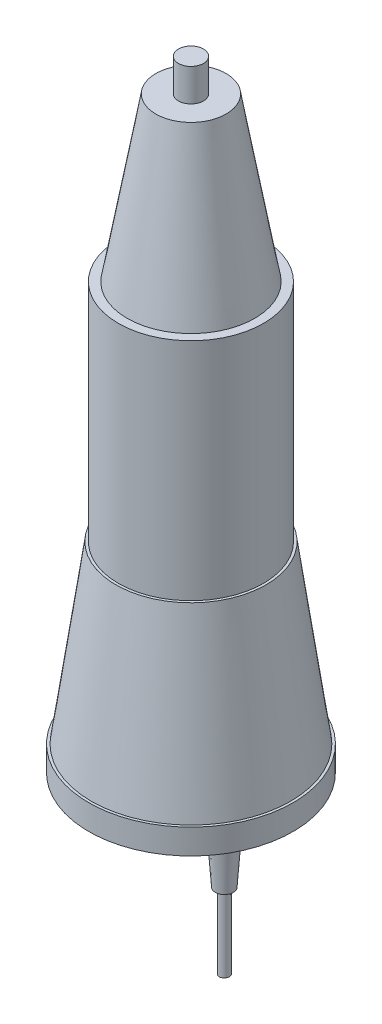
ISO-10303-21;
HEADER;
FILE_DESCRIPTION(('STEP AP214'),'2;1');
FILE_NAME('part.step','',(''),(''),'','','');
FILE_SCHEMA(('AUTOMOTIVE_DESIGN { 1 0 10303 214 1 1 1 1 }'));
ENDSEC;
DATA;
#1=APPLICATION_CONTEXT('core data for automotive mechanical design processes');
#2=APPLICATION_PROTOCOL_DEFINITION('international standard','automotive_design',2000,#1);
#3=PRODUCT_CONTEXT('',#1,'mechanical');
#4=PRODUCT('Part','Part','',(#3));
#5=PRODUCT_RELATED_PRODUCT_CATEGORY('part','',(#4));
#6=PRODUCT_DEFINITION_FORMATION('','',#4);
#7=PRODUCT_DEFINITION_CONTEXT('part definition',#1,'design');
#8=PRODUCT_DEFINITION('design','',#6,#7);
#9=PRODUCT_DEFINITION_SHAPE('','',#8);
#10=(LENGTH_UNIT() NAMED_UNIT(*) SI_UNIT(.MILLI.,.METRE.));
#11=(NAMED_UNIT(*) PLANE_ANGLE_UNIT() SI_UNIT($,.RADIAN.));
#12=(NAMED_UNIT(*) SI_UNIT($,.STERADIAN.) SOLID_ANGLE_UNIT());
#13=UNCERTAINTY_MEASURE_WITH_UNIT(LENGTH_MEASURE(1.E-05),#10,'distance_accuracy_value','');
#14=(GEOMETRIC_REPRESENTATION_CONTEXT(3) GLOBAL_UNCERTAINTY_ASSIGNED_CONTEXT((#13)) GLOBAL_UNIT_ASSIGNED_CONTEXT((#10,
#11,#12)) REPRESENTATION_CONTEXT('',''));
#15=CARTESIAN_POINT('',(0.,0.,0.));
#16=DIRECTION('',(0.,0.,1.));
#17=DIRECTION('',(1.,0.,0.));
#18=AXIS2_PLACEMENT_3D('',#15,#16,#17);
#19=CARTESIAN_POINT('',(0.,90.,0.));
#20=DIRECTION('',(0.,-1.,0.));
#21=DIRECTION('',(0.,0.,-1.));
#22=AXIS2_PLACEMENT_3D('',#19,#20,#21);
#23=CYLINDRICAL_SURFACE('',#22,29.);
#24=CARTESIAN_POINT('',(0.,90.,0.));
#25=DIRECTION('',(0.,1.,0.));
#26=DIRECTION('',(0.,0.,1.));
#27=AXIS2_PLACEMENT_3D('',#24,#25,#26);
#28=CIRCLE('',#27,29.);
#29=CARTESIAN_POINT('',(0.,90.,29.));
#30=VERTEX_POINT('',#29);
#31=EDGE_CURVE('E88',#30,#30,#28,.T.);
#32=ORIENTED_EDGE('',*,*,#31,.F.);
#33=EDGE_LOOP('',(#32));
#34=FACE_BOUND('',#33,.T.);
#35=CARTESIAN_POINT('',(0.,0.,0.));
#36=DIRECTION('',(0.,1.,0.));
#37=DIRECTION('',(0.,0.,1.));
#38=AXIS2_PLACEMENT_3D('',#35,#36,#37);
#39=CIRCLE('',#38,29.);
#40=CARTESIAN_POINT('',(0.,0.,29.));
#41=VERTEX_POINT('',#40);
#42=EDGE_CURVE('E40',#41,#41,#39,.T.);
#43=ORIENTED_EDGE('',*,*,#42,.T.);
#44=EDGE_LOOP('',(#43));
#45=FACE_BOUND('',#44,.T.);
#46=ADVANCED_FACE('F37',(#34,#45),#23,.T.);
#47=CARTESIAN_POINT('',(0.,90.,0.));
#48=DIRECTION('',(0.,1.,0.));
#49=DIRECTION('',(0.,0.,1.));
#50=AXIS2_PLACEMENT_3D('',#47,#48,#49);
#51=PLANE('',#50);
#52=CARTESIAN_POINT('',(0.,90.,0.));
#53=DIRECTION('',(0.,1.,0.));
#54=DIRECTION('',(0.,0.,1.));
#55=AXIS2_PLACEMENT_3D('',#52,#53,#54);
#56=CIRCLE('',#55,25.5);
#57=CARTESIAN_POINT('',(0.,90.,25.5));
#58=VERTEX_POINT('',#57);
#59=EDGE_CURVE('E51',#58,#58,#56,.T.);
#60=ORIENTED_EDGE('',*,*,#59,.F.);
#61=EDGE_LOOP('',(#60));
#62=FACE_BOUND('',#61,.T.);
#63=ORIENTED_EDGE('',*,*,#31,.T.);
#64=EDGE_LOOP('',(#63));
#65=FACE_BOUND('',#64,.T.);
#66=ADVANCED_FACE('F95',(#62,#65),#51,.T.);
#67=CARTESIAN_POINT('',(0.,90.,0.));
#68=DIRECTION('',(0.,-1.,0.));
#69=DIRECTION('',(0.,0.,1.));
#70=AXIS2_PLACEMENT_3D('',#67,#68,#69);
#71=CONICAL_SURFACE('',#70,25.5,0.174532925199433);
#72=CARTESIAN_POINT('',(0.,155.,0.));
#73=DIRECTION('',(0.,1.,0.));
#74=DIRECTION('',(0.,0.,1.));
#75=AXIS2_PLACEMENT_3D('',#72,#73,#74);
#76=CIRCLE('',#75,14.0387462539497);
#77=CARTESIAN_POINT('',(0.,155.,14.0387462539497));
#78=VERTEX_POINT('',#77);
#79=EDGE_CURVE('E83',#78,#78,#76,.T.);
#80=ORIENTED_EDGE('',*,*,#79,.F.);
#81=EDGE_LOOP('',(#80));
#82=FACE_BOUND('',#81,.T.);
#83=ORIENTED_EDGE('',*,*,#59,.T.);
#84=EDGE_LOOP('',(#83));
#85=FACE_BOUND('',#84,.T.);
#86=ADVANCED_FACE('F155',(#82,#85),#71,.T.);
#87=CARTESIAN_POINT('',(0.,155.,0.));
#88=DIRECTION('',(0.,1.,0.));
#89=DIRECTION('',(0.,0.,1.));
#90=AXIS2_PLACEMENT_3D('',#87,#88,#89);
#91=PLANE('',#90);
#92=CARTESIAN_POINT('',(0.,155.,0.));
#93=DIRECTION('',(0.,1.,0.));
#94=DIRECTION('',(0.,0.,1.));
#95=AXIS2_PLACEMENT_3D('',#92,#93,#94);
#96=CIRCLE('',#95,5.);
#97=CARTESIAN_POINT('',(0.,155.,5.));
#98=VERTEX_POINT('',#97);
#99=EDGE_CURVE('E45',#98,#98,#96,.T.);
#100=ORIENTED_EDGE('',*,*,#99,.F.);
#101=EDGE_LOOP('',(#100));
#102=FACE_BOUND('',#101,.T.);
#103=ORIENTED_EDGE('',*,*,#79,.T.);
#104=EDGE_LOOP('',(#103));
#105=FACE_BOUND('',#104,.T.);
#106=ADVANCED_FACE('F151',(#102,#105),#91,.T.);
#107=CARTESIAN_POINT('',(0.,168.,0.));
#108=DIRECTION('',(0.,-1.,0.));
#109=DIRECTION('',(0.,0.,-1.));
#110=AXIS2_PLACEMENT_3D('',#107,#108,#109);
#111=CYLINDRICAL_SURFACE('',#110,5.);
#112=CARTESIAN_POINT('',(0.,168.,0.));
#113=DIRECTION('',(0.,1.,0.));
#114=DIRECTION('',(0.,0.,1.));
#115=AXIS2_PLACEMENT_3D('',#112,#113,#114);
#116=CIRCLE('',#115,5.);
#117=CARTESIAN_POINT('',(0.,168.,5.));
#118=VERTEX_POINT('',#117);
#119=EDGE_CURVE('E80',#118,#118,#116,.T.);
#120=ORIENTED_EDGE('',*,*,#119,.F.);
#121=EDGE_LOOP('',(#120));
#122=FACE_BOUND('',#121,.T.);
#123=ORIENTED_EDGE('',*,*,#99,.T.);
#124=EDGE_LOOP('',(#123));
#125=FACE_BOUND('',#124,.T.);
#126=ADVANCED_FACE('F147',(#122,#125),#111,.T.);
#127=CARTESIAN_POINT('',(0.,168.,0.));
#128=DIRECTION('',(0.,1.,0.));
#129=DIRECTION('',(0.,0.,1.));
#130=AXIS2_PLACEMENT_3D('',#127,#128,#129);
#131=PLANE('',#130);
#132=ORIENTED_EDGE('',*,*,#119,.T.);
#133=EDGE_LOOP('',(#132));
#134=FACE_BOUND('',#133,.T.);
#135=ADVANCED_FACE('F143',(#134),#131,.T.);
#136=CARTESIAN_POINT('',(0.,0.,0.));
#137=DIRECTION('',(0.,-1.,0.));
#138=DIRECTION('',(0.,0.,-1.));
#139=AXIS2_PLACEMENT_3D('',#136,#137,#138);
#140=CONICAL_SURFACE('',#139,30.,0.139626340159547);
#141=CARTESIAN_POINT('',(0.,-70.,0.));
#142=DIRECTION('',(0.,-1.,0.));
#143=DIRECTION('',(0.,0.,-1.));
#144=AXIS2_PLACEMENT_3D('',#141,#142,#143);
#145=CIRCLE('',#144,39.8378584291674);
#146=CARTESIAN_POINT('',(0.,-70.,-39.8378584291674));
#147=VERTEX_POINT('',#146);
#148=EDGE_CURVE('E76',#147,#147,#145,.T.);
#149=ORIENTED_EDGE('',*,*,#148,.F.);
#150=EDGE_LOOP('',(#149));
#151=FACE_BOUND('',#150,.T.);
#152=CARTESIAN_POINT('',(0.,0.,0.));
#153=DIRECTION('',(0.,-1.,0.));
#154=DIRECTION('',(0.,0.,-1.));
#155=AXIS2_PLACEMENT_3D('',#152,#153,#154);
#156=CIRCLE('',#155,30.);
#157=CARTESIAN_POINT('',(0.,0.,-30.));
#158=VERTEX_POINT('',#157);
#159=EDGE_CURVE('E69',#158,#158,#156,.T.);
#160=ORIENTED_EDGE('',*,*,#159,.T.);
#161=EDGE_LOOP('',(#160));
#162=FACE_BOUND('',#161,.T.);
#163=ADVANCED_FACE('F140',(#151,#162),#140,.T.);
#164=CARTESIAN_POINT('',(0.,0.,0.));
#165=DIRECTION('',(0.,-1.,0.));
#166=DIRECTION('',(0.,0.,-1.));
#167=AXIS2_PLACEMENT_3D('',#164,#165,#166);
#168=PLANE('',#167);
#169=ORIENTED_EDGE('',*,*,#42,.F.);
#170=EDGE_LOOP('',(#169));
#171=FACE_BOUND('',#170,.T.);
#172=ORIENTED_EDGE('',*,*,#159,.F.);
#173=EDGE_LOOP('',(#172));
#174=FACE_BOUND('',#173,.T.);
#175=ADVANCED_FACE('F136',(#171,#174),#168,.F.);
#176=CARTESIAN_POINT('',(0.,-80.,0.));
#177=DIRECTION('',(0.,1.,0.));
#178=DIRECTION('',(0.,0.,1.));
#179=AXIS2_PLACEMENT_3D('',#176,#177,#178);
#180=CYLINDRICAL_SURFACE('',#179,40.8378584291674);
#181=CARTESIAN_POINT('',(0.,-80.,0.));
#182=DIRECTION('',(0.,-1.,0.));
#183=DIRECTION('',(0.,0.,-1.));
#184=AXIS2_PLACEMENT_3D('',#181,#182,#183);
#185=CIRCLE('',#184,40.8378584291674);
#186=CARTESIAN_POINT('',(0.,-80.,-40.8378584291674));
#187=VERTEX_POINT('',#186);
#188=EDGE_CURVE('E65',#187,#187,#185,.T.);
#189=ORIENTED_EDGE('',*,*,#188,.F.);
#190=EDGE_LOOP('',(#189));
#191=FACE_BOUND('',#190,.T.);
#192=CARTESIAN_POINT('',(0.,-70.,0.));
#193=DIRECTION('',(0.,-1.,0.));
#194=DIRECTION('',(0.,0.,-1.));
#195=AXIS2_PLACEMENT_3D('',#192,#193,#194);
#196=CIRCLE('',#195,40.8378584291674);
#197=CARTESIAN_POINT('',(0.,-70.,-40.8378584291674));
#198=VERTEX_POINT('',#197);
#199=EDGE_CURVE('E64',#198,#198,#196,.T.);
#200=ORIENTED_EDGE('',*,*,#199,.T.);
#201=EDGE_LOOP('',(#200));
#202=FACE_BOUND('',#201,.T.);
#203=ADVANCED_FACE('F129',(#191,#202),#180,.T.);
#204=CARTESIAN_POINT('',(0.,-80.,0.));
#205=DIRECTION('',(0.,-1.,0.));
#206=DIRECTION('',(0.,0.,-1.));
#207=AXIS2_PLACEMENT_3D('',#204,#205,#206);
#208=PLANE('',#207);
#209=CARTESIAN_POINT('',(26.3462993138148,-80.,13.00354037879));
#210=DIRECTION('',(0.,-1.,0.));
#211=DIRECTION('',(0.,0.,-1.));
#212=AXIS2_PLACEMENT_3D('',#209,#210,#211);
#213=CIRCLE('',#212,5.);
#214=CARTESIAN_POINT('',(26.3462993138148,-80.,8.00354037879003));
#215=VERTEX_POINT('',#214);
#216=EDGE_CURVE('E56',#215,#215,#213,.T.);
#217=ORIENTED_EDGE('',*,*,#216,.F.);
#218=EDGE_LOOP('',(#217));
#219=FACE_BOUND('',#218,.T.);
#220=ORIENTED_EDGE('',*,*,#188,.T.);
#221=EDGE_LOOP('',(#220));
#222=FACE_BOUND('',#221,.T.);
#223=ADVANCED_FACE('F126',(#219,#222),#208,.T.);
#224=CARTESIAN_POINT('',(0.,-70.,0.));
#225=DIRECTION('',(0.,-1.,0.));
#226=DIRECTION('',(0.,0.,-1.));
#227=AXIS2_PLACEMENT_3D('',#224,#225,#226);
#228=PLANE('',#227);
#229=ORIENTED_EDGE('',*,*,#148,.T.);
#230=EDGE_LOOP('',(#229));
#231=FACE_BOUND('',#230,.T.);
#232=ORIENTED_EDGE('',*,*,#199,.F.);
#233=EDGE_LOOP('',(#232));
#234=FACE_BOUND('',#233,.T.);
#235=ADVANCED_FACE('F124',(#231,#234),#228,.F.);
#236=CARTESIAN_POINT('',(26.3462993138148,-80.,13.00354037879));
#237=DIRECTION('',(0.,1.,0.));
#238=DIRECTION('',(0.,0.,-1.));
#239=AXIS2_PLACEMENT_3D('',#236,#237,#238);
#240=CONICAL_SURFACE('',#239,5.,0.0698131700797736);
#241=CARTESIAN_POINT('',(26.3462993138148,-100.,13.00354037879));
#242=DIRECTION('',(0.,-1.,0.));
#243=DIRECTION('',(0.,0.,-1.));
#244=AXIS2_PLACEMENT_3D('',#241,#242,#243);
#245=CIRCLE('',#244,3.60146376112979);
#246=CARTESIAN_POINT('',(26.3462993138148,-100.,9.40207661766025));
#247=VERTEX_POINT('',#246);
#248=EDGE_CURVE('E60',#247,#247,#245,.T.);
#249=ORIENTED_EDGE('',*,*,#248,.F.);
#250=EDGE_LOOP('',(#249));
#251=FACE_BOUND('',#250,.T.);
#252=ORIENTED_EDGE('',*,*,#216,.T.);
#253=EDGE_LOOP('',(#252));
#254=FACE_BOUND('',#253,.T.);
#255=ADVANCED_FACE('F118',(#251,#254),#240,.T.);
#256=CARTESIAN_POINT('',(26.3462993138148,-100.,13.00354037879));
#257=DIRECTION('',(0.,-1.,0.));
#258=DIRECTION('',(0.,0.,-1.));
#259=AXIS2_PLACEMENT_3D('',#256,#257,#258);
#260=PLANE('',#259);
#261=CARTESIAN_POINT('',(26.3462993138148,-100.,13.00354037879));
#262=DIRECTION('',(0.,-1.,0.));
#263=DIRECTION('',(0.,0.,-1.));
#264=AXIS2_PLACEMENT_3D('',#261,#262,#263);
#265=CIRCLE('',#264,2.);
#266=CARTESIAN_POINT('',(26.3462993138148,-100.,11.00354037879));
#267=VERTEX_POINT('',#266);
#268=EDGE_CURVE('E10',#267,#267,#265,.T.);
#269=ORIENTED_EDGE('',*,*,#268,.F.);
#270=EDGE_LOOP('',(#269));
#271=FACE_BOUND('',#270,.T.);
#272=ORIENTED_EDGE('',*,*,#248,.T.);
#273=EDGE_LOOP('',(#272));
#274=FACE_BOUND('',#273,.T.);
#275=ADVANCED_FACE('F111',(#271,#274),#260,.T.);
#276=CARTESIAN_POINT('',(26.3462993138148,-130.,13.00354037879));
#277=DIRECTION('',(0.,1.,0.));
#278=DIRECTION('',(0.,0.,1.));
#279=AXIS2_PLACEMENT_3D('',#276,#277,#278);
#280=CYLINDRICAL_SURFACE('',#279,2.);
#281=CARTESIAN_POINT('',(26.3462993138148,-130.,13.00354037879));
#282=DIRECTION('',(0.,-1.,0.));
#283=DIRECTION('',(0.,0.,-1.));
#284=AXIS2_PLACEMENT_3D('',#281,#282,#283);
#285=CIRCLE('',#284,2.);
#286=CARTESIAN_POINT('',(26.3462993138148,-130.,11.00354037879));
#287=VERTEX_POINT('',#286);
#288=EDGE_CURVE('E55',#287,#287,#285,.T.);
#289=ORIENTED_EDGE('',*,*,#288,.F.);
#290=EDGE_LOOP('',(#289));
#291=FACE_BOUND('',#290,.T.);
#292=ORIENTED_EDGE('',*,*,#268,.T.);
#293=EDGE_LOOP('',(#292));
#294=FACE_BOUND('',#293,.T.);
#295=ADVANCED_FACE('F109',(#291,#294),#280,.T.);
#296=CARTESIAN_POINT('',(26.3462993138148,-130.,13.00354037879));
#297=DIRECTION('',(0.,-1.,0.));
#298=DIRECTION('',(0.,0.,-1.));
#299=AXIS2_PLACEMENT_3D('',#296,#297,#298);
#300=PLANE('',#299);
#301=ORIENTED_EDGE('',*,*,#288,.T.);
#302=EDGE_LOOP('',(#301));
#303=FACE_BOUND('',#302,.T.);
#304=ADVANCED_FACE('F107',(#303),#300,.T.);
#305=CLOSED_SHELL('',(#46,#66,#86,#106,#126,#135,#163,#175,#203,#223,#235,#255,#275,#295,#304));
#306=MANIFOLD_SOLID_BREP('B2',#305);
#307=ADVANCED_BREP_SHAPE_REPRESENTATION('',(#18,#306),#14);
#308=SHAPE_DEFINITION_REPRESENTATION(#9,#307);
ENDSEC;
END-ISO-10303-21;
